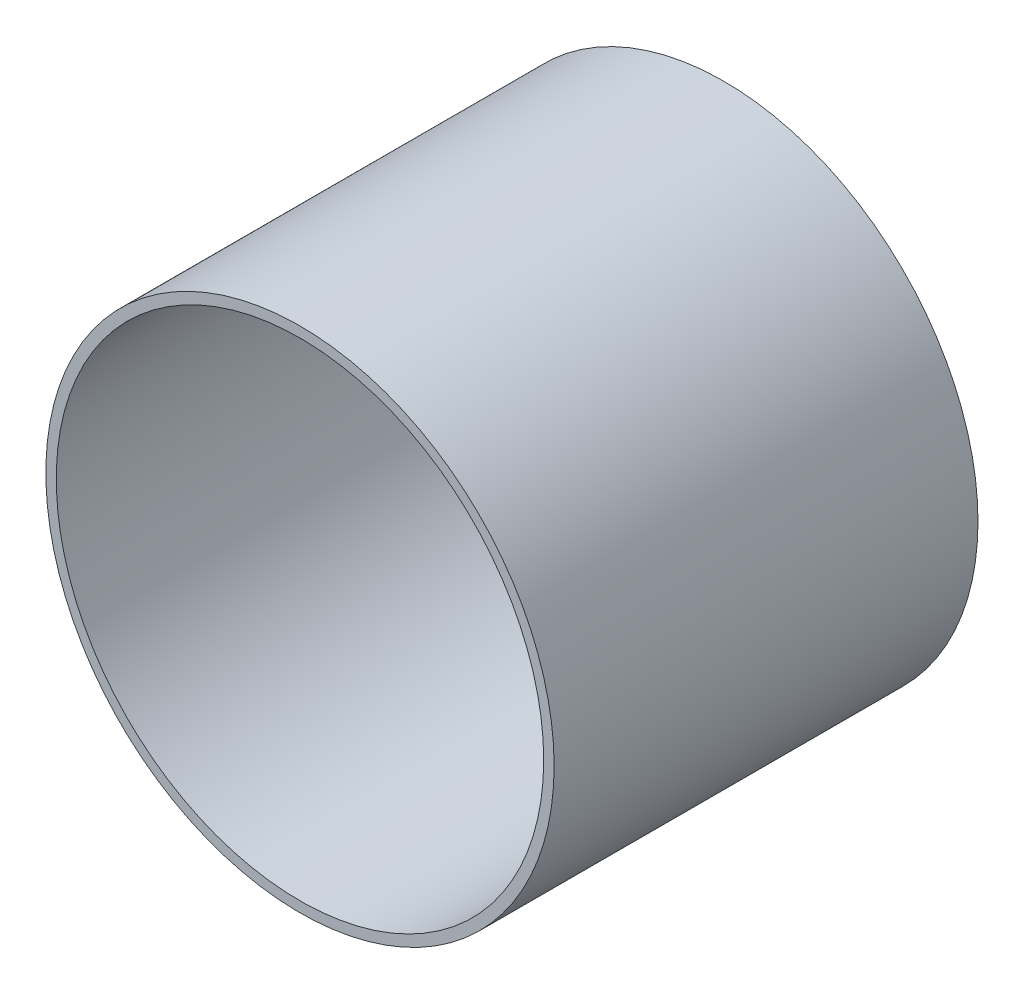
ISO-10303-21;
HEADER;
FILE_DESCRIPTION(('STEP AP214'),'2;1');
FILE_NAME('part.step','',(''),(''),'','','');
FILE_SCHEMA(('AUTOMOTIVE_DESIGN { 1 0 10303 214 1 1 1 1 }'));
ENDSEC;
DATA;
#1=APPLICATION_CONTEXT('core data for automotive mechanical design processes');
#2=APPLICATION_PROTOCOL_DEFINITION('international standard','automotive_design',2000,#1);
#3=PRODUCT_CONTEXT('',#1,'mechanical');
#4=PRODUCT('Part','Part','',(#3));
#5=PRODUCT_RELATED_PRODUCT_CATEGORY('part','',(#4));
#6=PRODUCT_DEFINITION_FORMATION('','',#4);
#7=PRODUCT_DEFINITION_CONTEXT('part definition',#1,'design');
#8=PRODUCT_DEFINITION('design','',#6,#7);
#9=PRODUCT_DEFINITION_SHAPE('','',#8);
#10=(LENGTH_UNIT() NAMED_UNIT(*) SI_UNIT(.MILLI.,.METRE.));
#11=(NAMED_UNIT(*) PLANE_ANGLE_UNIT() SI_UNIT($,.RADIAN.));
#12=(NAMED_UNIT(*) SI_UNIT($,.STERADIAN.) SOLID_ANGLE_UNIT());
#13=UNCERTAINTY_MEASURE_WITH_UNIT(LENGTH_MEASURE(1.E-05),#10,'distance_accuracy_value','');
#14=(GEOMETRIC_REPRESENTATION_CONTEXT(3) GLOBAL_UNCERTAINTY_ASSIGNED_CONTEXT((#13)) GLOBAL_UNIT_ASSIGNED_CONTEXT((#10,
#11,#12)) REPRESENTATION_CONTEXT('',''));
#15=CARTESIAN_POINT('',(0.,0.,0.));
#16=DIRECTION('',(0.,0.,1.));
#17=DIRECTION('',(1.,0.,0.));
#18=AXIS2_PLACEMENT_3D('',#15,#16,#17);
#19=CARTESIAN_POINT('',(0.,0.,31.75));
#20=DIRECTION('',(0.,0.,1.));
#21=DIRECTION('',(1.,0.,0.));
#22=AXIS2_PLACEMENT_3D('',#19,#20,#21);
#23=PLANE('',#22);
#24=CARTESIAN_POINT('',(0.,0.,31.75));
#25=DIRECTION('',(0.,0.,1.));
#26=DIRECTION('',(1.,0.,0.));
#27=AXIS2_PLACEMENT_3D('',#24,#25,#26);
#28=CIRCLE('',#27,38.0746);
#29=CARTESIAN_POINT('',(38.0746,0.,31.75));
#30=VERTEX_POINT('',#29);
#31=EDGE_CURVE('E10',#30,#30,#28,.T.);
#32=ORIENTED_EDGE('',*,*,#31,.T.);
#33=EDGE_LOOP('',(#32));
#34=FACE_BOUND('',#33,.T.);
#35=CARTESIAN_POINT('',(0.,0.,31.75));
#36=DIRECTION('',(0.,0.,1.));
#37=DIRECTION('',(1.,0.,0.));
#38=AXIS2_PLACEMENT_3D('',#35,#36,#37);
#39=CIRCLE('',#38,36.5125);
#40=CARTESIAN_POINT('',(36.5125,0.,31.75));
#41=VERTEX_POINT('',#40);
#42=EDGE_CURVE('E54',#41,#41,#39,.T.);
#43=ORIENTED_EDGE('',*,*,#42,.F.);
#44=EDGE_LOOP('',(#43));
#45=FACE_BOUND('',#44,.T.);
#46=ADVANCED_FACE('F43',(#34,#45),#23,.T.);
#47=CARTESIAN_POINT('',(0.,0.,-31.75));
#48=DIRECTION('',(0.,0.,1.));
#49=DIRECTION('',(1.,0.,0.));
#50=AXIS2_PLACEMENT_3D('',#47,#48,#49);
#51=PLANE('',#50);
#52=CARTESIAN_POINT('',(0.,0.,-31.75));
#53=DIRECTION('',(0.,0.,1.));
#54=DIRECTION('',(1.,0.,0.));
#55=AXIS2_PLACEMENT_3D('',#52,#53,#54);
#56=CIRCLE('',#55,38.0746);
#57=CARTESIAN_POINT('',(38.0746,0.,-31.75));
#58=VERTEX_POINT('',#57);
#59=EDGE_CURVE('E47',#58,#58,#56,.T.);
#60=ORIENTED_EDGE('',*,*,#59,.F.);
#61=EDGE_LOOP('',(#60));
#62=FACE_BOUND('',#61,.T.);
#63=CARTESIAN_POINT('',(0.,0.,-31.75));
#64=DIRECTION('',(0.,0.,1.));
#65=DIRECTION('',(1.,0.,0.));
#66=AXIS2_PLACEMENT_3D('',#63,#64,#65);
#67=CIRCLE('',#66,36.5125);
#68=CARTESIAN_POINT('',(36.5125,0.,-31.75));
#69=VERTEX_POINT('',#68);
#70=EDGE_CURVE('E56',#69,#69,#67,.T.);
#71=ORIENTED_EDGE('',*,*,#70,.T.);
#72=EDGE_LOOP('',(#71));
#73=FACE_BOUND('',#72,.T.);
#74=ADVANCED_FACE('F66',(#62,#73),#51,.F.);
#75=CARTESIAN_POINT('',(0.,0.,31.75));
#76=DIRECTION('',(0.,0.,-1.));
#77=DIRECTION('',(-1.,0.,0.));
#78=AXIS2_PLACEMENT_3D('',#75,#76,#77);
#79=CYLINDRICAL_SURFACE('',#78,38.0746);
#80=ORIENTED_EDGE('',*,*,#31,.F.);
#81=EDGE_LOOP('',(#80));
#82=FACE_BOUND('',#81,.T.);
#83=ORIENTED_EDGE('',*,*,#59,.T.);
#84=EDGE_LOOP('',(#83));
#85=FACE_BOUND('',#84,.T.);
#86=ADVANCED_FACE('F45',(#82,#85),#79,.T.);
#87=CARTESIAN_POINT('',(0.,0.,31.75));
#88=DIRECTION('',(0.,0.,-1.));
#89=DIRECTION('',(-1.,0.,0.));
#90=AXIS2_PLACEMENT_3D('',#87,#88,#89);
#91=CYLINDRICAL_SURFACE('',#90,36.5125);
#92=ORIENTED_EDGE('',*,*,#42,.T.);
#93=EDGE_LOOP('',(#92));
#94=FACE_BOUND('',#93,.T.);
#95=ORIENTED_EDGE('',*,*,#70,.F.);
#96=EDGE_LOOP('',(#95));
#97=FACE_BOUND('',#96,.T.);
#98=ADVANCED_FACE('F62',(#94,#97),#91,.F.);
#99=CLOSED_SHELL('',(#46,#74,#86,#98));
#100=MANIFOLD_SOLID_BREP('B2',#99);
#101=ADVANCED_BREP_SHAPE_REPRESENTATION('',(#18,#100),#14);
#102=SHAPE_DEFINITION_REPRESENTATION(#9,#101);
ENDSEC;
END-ISO-10303-21;
